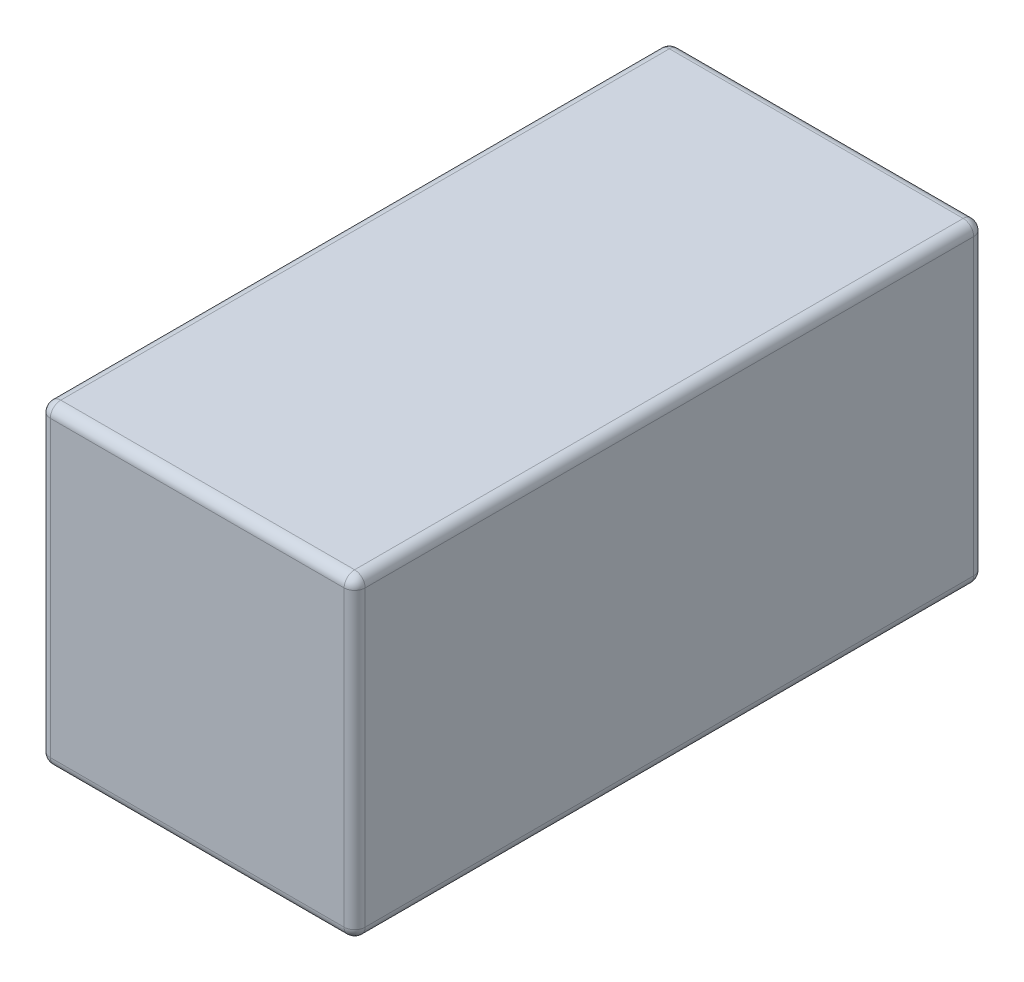
ISO-10303-21;
HEADER;
FILE_DESCRIPTION(('STEP AP214'),'2;1');
FILE_NAME('part.step','',(''),(''),'','','');
FILE_SCHEMA(('AUTOMOTIVE_DESIGN { 1 0 10303 214 1 1 1 1 }'));
ENDSEC;
DATA;
#1=APPLICATION_CONTEXT('core data for automotive mechanical design processes');
#2=APPLICATION_PROTOCOL_DEFINITION('international standard','automotive_design',2000,#1);
#3=PRODUCT_CONTEXT('',#1,'mechanical');
#4=PRODUCT('Part','Part','',(#3));
#5=PRODUCT_RELATED_PRODUCT_CATEGORY('part','',(#4));
#6=PRODUCT_DEFINITION_FORMATION('','',#4);
#7=PRODUCT_DEFINITION_CONTEXT('part definition',#1,'design');
#8=PRODUCT_DEFINITION('design','',#6,#7);
#9=PRODUCT_DEFINITION_SHAPE('','',#8);
#10=(LENGTH_UNIT() NAMED_UNIT(*) SI_UNIT(.MILLI.,.METRE.));
#11=(NAMED_UNIT(*) PLANE_ANGLE_UNIT() SI_UNIT($,.RADIAN.));
#12=(NAMED_UNIT(*) SI_UNIT($,.STERADIAN.) SOLID_ANGLE_UNIT());
#13=UNCERTAINTY_MEASURE_WITH_UNIT(LENGTH_MEASURE(1.E-05),#10,'distance_accuracy_value','');
#14=(GEOMETRIC_REPRESENTATION_CONTEXT(3) GLOBAL_UNCERTAINTY_ASSIGNED_CONTEXT((#13)) GLOBAL_UNIT_ASSIGNED_CONTEXT((#10,
#11,#12)) REPRESENTATION_CONTEXT('',''));
#15=CARTESIAN_POINT('',(0.,0.,0.));
#16=DIRECTION('',(0.,0.,1.));
#17=DIRECTION('',(1.,0.,0.));
#18=AXIS2_PLACEMENT_3D('',#15,#16,#17);
#19=CARTESIAN_POINT('',(3.,-3.00000000000001,6.00000000000001));
#20=DIRECTION('',(0.,1.,0.));
#21=DIRECTION('',(-1.,0.,0.));
#22=AXIS2_PLACEMENT_3D('',#19,#20,#21);
#23=PLANE('',#22);
#24=DIRECTION('',(1.,0.,0.));
#25=VECTOR('',#24,1.);
#26=CARTESIAN_POINT('',(3.,-3.00000000000001,5.8));
#27=LINE('',#26,#25);
#28=CARTESIAN_POINT('',(2.8,-3.,5.8));
#29=VERTEX_POINT('',#28);
#30=CARTESIAN_POINT('',(-2.8,-3.00000000000001,5.8));
#31=VERTEX_POINT('',#30);
#32=EDGE_CURVE('E135',#29,#31,#27,.F.);
#33=ORIENTED_EDGE('',*,*,#32,.T.);
#34=DIRECTION('',(0.,0.,-1.));
#35=VECTOR('',#34,1.);
#36=CARTESIAN_POINT('',(-2.8,-3.00000000000001,6.00000000000001));
#37=LINE('',#36,#35);
#38=CARTESIAN_POINT('',(-2.8,-3.00000000000001,-5.8));
#39=VERTEX_POINT('',#38);
#40=EDGE_CURVE('E178',#31,#39,#37,.T.);
#41=ORIENTED_EDGE('',*,*,#40,.T.);
#42=DIRECTION('',(1.,0.,0.));
#43=VECTOR('',#42,1.);
#44=CARTESIAN_POINT('',(3.,-3.00000000000001,-5.8));
#45=LINE('',#44,#43);
#46=CARTESIAN_POINT('',(2.8,-3.,-5.8));
#47=VERTEX_POINT('',#46);
#48=EDGE_CURVE('E138',#39,#47,#45,.T.);
#49=ORIENTED_EDGE('',*,*,#48,.T.);
#50=DIRECTION('',(0.,0.,-1.));
#51=VECTOR('',#50,1.);
#52=CARTESIAN_POINT('',(2.8,-3.,6.00000000000001));
#53=LINE('',#52,#51);
#54=EDGE_CURVE('E131',#47,#29,#53,.F.);
#55=ORIENTED_EDGE('',*,*,#54,.T.);
#56=EDGE_LOOP('',(#33,#41,#49,#55));
#57=FACE_BOUND('',#56,.T.);
#58=ADVANCED_FACE('F42',(#57),#23,.F.);
#59=CARTESIAN_POINT('',(3.,-3.00000000000001,6.00000000000001));
#60=DIRECTION('',(-1.,0.,0.));
#61=DIRECTION('',(0.,0.,1.));
#62=AXIS2_PLACEMENT_3D('',#59,#60,#61);
#63=PLANE('',#62);
#64=DIRECTION('',(0.,1.,0.));
#65=VECTOR('',#64,1.);
#66=CARTESIAN_POINT('',(3.,2.99999999999999,-5.8));
#67=LINE('',#66,#65);
#68=CARTESIAN_POINT('',(3.,-2.80000000000001,-5.8));
#69=VERTEX_POINT('',#68);
#70=CARTESIAN_POINT('',(3.,2.79999999999999,-5.8));
#71=VERTEX_POINT('',#70);
#72=EDGE_CURVE('E225',#69,#71,#67,.T.);
#73=ORIENTED_EDGE('',*,*,#72,.T.);
#74=DIRECTION('',(0.,0.,-1.));
#75=VECTOR('',#74,1.);
#76=CARTESIAN_POINT('',(3.,2.79999999999999,6.00000000000001));
#77=LINE('',#76,#75);
#78=CARTESIAN_POINT('',(3.,2.79999999999999,5.8));
#79=VERTEX_POINT('',#78);
#80=EDGE_CURVE('E228',#71,#79,#77,.F.);
#81=ORIENTED_EDGE('',*,*,#80,.T.);
#82=DIRECTION('',(0.,1.,0.));
#83=VECTOR('',#82,1.);
#84=CARTESIAN_POINT('',(3.,-3.00000000000001,5.8));
#85=LINE('',#84,#83);
#86=CARTESIAN_POINT('',(3.,-2.80000000000001,5.8));
#87=VERTEX_POINT('',#86);
#88=EDGE_CURVE('E220',#79,#87,#85,.F.);
#89=ORIENTED_EDGE('',*,*,#88,.T.);
#90=DIRECTION('',(0.,0.,-1.));
#91=VECTOR('',#90,1.);
#92=CARTESIAN_POINT('',(3.,-2.80000000000001,6.00000000000001));
#93=LINE('',#92,#91);
#94=EDGE_CURVE('E149',#87,#69,#93,.T.);
#95=ORIENTED_EDGE('',*,*,#94,.T.);
#96=EDGE_LOOP('',(#73,#81,#89,#95));
#97=FACE_BOUND('',#96,.T.);
#98=ADVANCED_FACE('F353',(#97),#63,.F.);
#99=CARTESIAN_POINT('',(3.,2.99999999999999,6.00000000000001));
#100=DIRECTION('',(0.,-1.,0.));
#101=DIRECTION('',(1.,0.,0.));
#102=AXIS2_PLACEMENT_3D('',#99,#100,#101);
#103=PLANE('',#102);
#104=DIRECTION('',(-1.,0.,0.));
#105=VECTOR('',#104,1.);
#106=CARTESIAN_POINT('',(-3.,3.,-5.8));
#107=LINE('',#106,#105);
#108=CARTESIAN_POINT('',(2.8,3.,-5.8));
#109=VERTEX_POINT('',#108);
#110=CARTESIAN_POINT('',(-2.8,2.99999999999999,-5.8));
#111=VERTEX_POINT('',#110);
#112=EDGE_CURVE('E213',#109,#111,#107,.T.);
#113=ORIENTED_EDGE('',*,*,#112,.T.);
#114=DIRECTION('',(0.,0.,-1.));
#115=VECTOR('',#114,1.);
#116=CARTESIAN_POINT('',(-2.8,2.99999999999999,6.00000000000001));
#117=LINE('',#116,#115);
#118=CARTESIAN_POINT('',(-2.8,2.99999999999999,5.8));
#119=VERTEX_POINT('',#118);
#120=EDGE_CURVE('E216',#111,#119,#117,.F.);
#121=ORIENTED_EDGE('',*,*,#120,.T.);
#122=DIRECTION('',(-1.,0.,0.));
#123=VECTOR('',#122,1.);
#124=CARTESIAN_POINT('',(3.,2.99999999999999,5.8));
#125=LINE('',#124,#123);
#126=CARTESIAN_POINT('',(2.8,3.,5.8));
#127=VERTEX_POINT('',#126);
#128=EDGE_CURVE('E207',#119,#127,#125,.F.);
#129=ORIENTED_EDGE('',*,*,#128,.T.);
#130=DIRECTION('',(0.,0.,-1.));
#131=VECTOR('',#130,1.);
#132=CARTESIAN_POINT('',(2.8,3.,6.00000000000001));
#133=LINE('',#132,#131);
#134=EDGE_CURVE('E210',#127,#109,#133,.T.);
#135=ORIENTED_EDGE('',*,*,#134,.T.);
#136=EDGE_LOOP('',(#113,#121,#129,#135));
#137=FACE_BOUND('',#136,.T.);
#138=ADVANCED_FACE('F333',(#137),#103,.F.);
#139=CARTESIAN_POINT('',(-3.,-3.,6.00000000000001));
#140=DIRECTION('',(1.,0.,0.));
#141=DIRECTION('',(0.,0.,-1.));
#142=AXIS2_PLACEMENT_3D('',#139,#140,#141);
#143=PLANE('',#142);
#144=DIRECTION('',(0.,-1.,0.));
#145=VECTOR('',#144,1.);
#146=CARTESIAN_POINT('',(-3.,-3.,-5.8));
#147=LINE('',#146,#145);
#148=CARTESIAN_POINT('',(-3.,2.8,-5.8));
#149=VERTEX_POINT('',#148);
#150=CARTESIAN_POINT('',(-3.,-2.8,-5.8));
#151=VERTEX_POINT('',#150);
#152=EDGE_CURVE('E187',#149,#151,#147,.T.);
#153=ORIENTED_EDGE('',*,*,#152,.T.);
#154=DIRECTION('',(0.,0.,-1.));
#155=VECTOR('',#154,1.);
#156=CARTESIAN_POINT('',(-3.,-2.8,6.00000000000001));
#157=LINE('',#156,#155);
#158=CARTESIAN_POINT('',(-3.,-2.8,5.8));
#159=VERTEX_POINT('',#158);
#160=EDGE_CURVE('E190',#151,#159,#157,.F.);
#161=ORIENTED_EDGE('',*,*,#160,.T.);
#162=DIRECTION('',(0.,-1.,0.));
#163=VECTOR('',#162,1.);
#164=CARTESIAN_POINT('',(-3.,-3.,5.8));
#165=LINE('',#164,#163);
#166=CARTESIAN_POINT('',(-3.,2.8,5.8));
#167=VERTEX_POINT('',#166);
#168=EDGE_CURVE('E181',#159,#167,#165,.F.);
#169=ORIENTED_EDGE('',*,*,#168,.T.);
#170=DIRECTION('',(0.,0.,-1.));
#171=VECTOR('',#170,1.);
#172=CARTESIAN_POINT('',(-3.,2.8,6.00000000000001));
#173=LINE('',#172,#171);
#174=EDGE_CURVE('E184',#167,#149,#173,.T.);
#175=ORIENTED_EDGE('',*,*,#174,.T.);
#176=EDGE_LOOP('',(#153,#161,#169,#175));
#177=FACE_BOUND('',#176,.T.);
#178=ADVANCED_FACE('F360',(#177),#143,.F.);
#179=CARTESIAN_POINT('',(0.,0.,6.00000000000001));
#180=DIRECTION('',(0.,0.,-1.));
#181=DIRECTION('',(-1.,0.,0.));
#182=AXIS2_PLACEMENT_3D('',#179,#180,#181);
#183=PLANE('',#182);
#184=DIRECTION('',(-1.,0.,0.));
#185=VECTOR('',#184,1.);
#186=CARTESIAN_POINT('',(0.,2.8,6.00000000000001));
#187=LINE('',#186,#185);
#188=CARTESIAN_POINT('',(2.8,2.8,6.00000000000001));
#189=VERTEX_POINT('',#188);
#190=CARTESIAN_POINT('',(-2.8,2.79999999999999,6.00000000000001));
#191=VERTEX_POINT('',#190);
#192=EDGE_CURVE('E52',#189,#191,#187,.T.);
#193=ORIENTED_EDGE('',*,*,#192,.T.);
#194=DIRECTION('',(0.,-1.,0.));
#195=VECTOR('',#194,1.);
#196=CARTESIAN_POINT('',(-2.8,0.,6.00000000000001));
#197=LINE('',#196,#195);
#198=CARTESIAN_POINT('',(-2.8,-2.80000000000001,6.00000000000001));
#199=VERTEX_POINT('',#198);
#200=EDGE_CURVE('E11',#191,#199,#197,.T.);
#201=ORIENTED_EDGE('',*,*,#200,.T.);
#202=DIRECTION('',(1.,0.,0.));
#203=VECTOR('',#202,1.);
#204=CARTESIAN_POINT('',(0.,-2.8,6.00000000000001));
#205=LINE('',#204,#203);
#206=CARTESIAN_POINT('',(2.8,-2.8,6.00000000000001));
#207=VERTEX_POINT('',#206);
#208=EDGE_CURVE('E232',#199,#207,#205,.T.);
#209=ORIENTED_EDGE('',*,*,#208,.T.);
#210=DIRECTION('',(0.,1.,0.));
#211=VECTOR('',#210,1.);
#212=CARTESIAN_POINT('',(2.8,0.,6.00000000000001));
#213=LINE('',#212,#211);
#214=EDGE_CURVE('E63',#207,#189,#213,.T.);
#215=ORIENTED_EDGE('',*,*,#214,.T.);
#216=EDGE_LOOP('',(#193,#201,#209,#215));
#217=FACE_BOUND('',#216,.T.);
#218=ADVANCED_FACE('F424',(#217),#183,.F.);
#219=CARTESIAN_POINT('',(0.,0.,-6.00000000000001));
#220=DIRECTION('',(0.,0.,-1.));
#221=DIRECTION('',(-1.,0.,0.));
#222=AXIS2_PLACEMENT_3D('',#219,#220,#221);
#223=PLANE('',#222);
#224=DIRECTION('',(1.,0.,0.));
#225=VECTOR('',#224,1.);
#226=CARTESIAN_POINT('',(-3.,-2.8,-6.00000000000001));
#227=LINE('',#226,#225);
#228=CARTESIAN_POINT('',(2.8,-2.8,-6.00000000000001));
#229=VERTEX_POINT('',#228);
#230=CARTESIAN_POINT('',(-2.8,-2.80000000000001,-6.00000000000001));
#231=VERTEX_POINT('',#230);
#232=EDGE_CURVE('E200',#229,#231,#227,.F.);
#233=ORIENTED_EDGE('',*,*,#232,.T.);
#234=DIRECTION('',(0.,-1.,0.));
#235=VECTOR('',#234,1.);
#236=CARTESIAN_POINT('',(-2.8,2.99999999999999,-6.00000000000001));
#237=LINE('',#236,#235);
#238=CARTESIAN_POINT('',(-2.8,2.79999999999999,-6.00000000000001));
#239=VERTEX_POINT('',#238);
#240=EDGE_CURVE('E203',#231,#239,#237,.F.);
#241=ORIENTED_EDGE('',*,*,#240,.T.);
#242=DIRECTION('',(-1.,0.,0.));
#243=VECTOR('',#242,1.);
#244=CARTESIAN_POINT('',(3.,2.79999999999999,-6.00000000000001));
#245=LINE('',#244,#243);
#246=CARTESIAN_POINT('',(2.8,2.8,-6.00000000000001));
#247=VERTEX_POINT('',#246);
#248=EDGE_CURVE('E197',#239,#247,#245,.F.);
#249=ORIENTED_EDGE('',*,*,#248,.T.);
#250=DIRECTION('',(0.,1.,0.));
#251=VECTOR('',#250,1.);
#252=CARTESIAN_POINT('',(2.8,-3.,-6.00000000000001));
#253=LINE('',#252,#251);
#254=EDGE_CURVE('E194',#247,#229,#253,.F.);
#255=ORIENTED_EDGE('',*,*,#254,.T.);
#256=EDGE_LOOP('',(#233,#241,#249,#255));
#257=FACE_BOUND('',#256,.T.);
#258=ADVANCED_FACE('F324',(#257),#223,.T.);
#259=CARTESIAN_POINT('',(2.8,2.8,6.00000000000001));
#260=DIRECTION('',(0.,0.,-1.));
#261=DIRECTION('',(-1.,0.,0.));
#262=AXIS2_PLACEMENT_3D('',#259,#260,#261);
#263=CYLINDRICAL_SURFACE('',#262,0.2);
#264=CARTESIAN_POINT('',(2.8,2.8,5.8));
#265=DIRECTION('',(0.,0.,1.));
#266=DIRECTION('',(1.,0.,0.));
#267=AXIS2_PLACEMENT_3D('',#264,#265,#266);
#268=CIRCLE('',#267,0.2);
#269=EDGE_CURVE('E46',#79,#127,#268,.T.);
#270=ORIENTED_EDGE('',*,*,#269,.F.);
#271=ORIENTED_EDGE('',*,*,#80,.F.);
#272=CARTESIAN_POINT('',(2.8,2.8,-5.8));
#273=DIRECTION('',(0.,0.,-1.));
#274=DIRECTION('',(-1.,0.,0.));
#275=AXIS2_PLACEMENT_3D('',#272,#273,#274);
#276=CIRCLE('',#275,0.2);
#277=EDGE_CURVE('E174',#109,#71,#276,.T.);
#278=ORIENTED_EDGE('',*,*,#277,.F.);
#279=ORIENTED_EDGE('',*,*,#134,.F.);
#280=EDGE_LOOP('',(#270,#271,#278,#279));
#281=FACE_BOUND('',#280,.T.);
#282=ADVANCED_FACE('F44',(#281),#263,.T.);
#283=CARTESIAN_POINT('',(2.8,2.8,5.8));
#284=DIRECTION('',(0.,0.,1.));
#285=DIRECTION('',(1.,0.,0.));
#286=AXIS2_PLACEMENT_3D('',#283,#284,#285);
#287=SPHERICAL_SURFACE('',#286,0.2);
#288=CARTESIAN_POINT('',(2.8,2.8,5.8));
#289=DIRECTION('',(0.,1.,0.));
#290=DIRECTION('',(0.,0.,1.));
#291=AXIS2_PLACEMENT_3D('',#288,#289,#290);
#292=CIRCLE('',#291,0.2);
#293=EDGE_CURVE('E299',#79,#189,#292,.F.);
#294=ORIENTED_EDGE('',*,*,#293,.F.);
#295=ORIENTED_EDGE('',*,*,#269,.T.);
#296=CARTESIAN_POINT('',(2.8,2.8,5.8));
#297=DIRECTION('',(1.,0.,0.));
#298=DIRECTION('',(0.,0.,-1.));
#299=AXIS2_PLACEMENT_3D('',#296,#297,#298);
#300=CIRCLE('',#299,0.2);
#301=EDGE_CURVE('E302',#189,#127,#300,.F.);
#302=ORIENTED_EDGE('',*,*,#301,.F.);
#303=EDGE_LOOP('',(#294,#295,#302));
#304=FACE_BOUND('',#303,.T.);
#305=ADVANCED_FACE('F349',(#304),#287,.T.);
#306=CARTESIAN_POINT('',(2.8,2.8,-5.8));
#307=DIRECTION('',(0.,0.,1.));
#308=DIRECTION('',(1.,0.,0.));
#309=AXIS2_PLACEMENT_3D('',#306,#307,#308);
#310=SPHERICAL_SURFACE('',#309,0.2);
#311=CARTESIAN_POINT('',(2.8,2.8,-5.8));
#312=DIRECTION('',(1.,0.,0.));
#313=DIRECTION('',(0.,0.,-1.));
#314=AXIS2_PLACEMENT_3D('',#311,#312,#313);
#315=CIRCLE('',#314,0.2);
#316=EDGE_CURVE('E291',#109,#247,#315,.F.);
#317=ORIENTED_EDGE('',*,*,#316,.F.);
#318=ORIENTED_EDGE('',*,*,#277,.T.);
#319=CARTESIAN_POINT('',(2.8,2.8,-5.8));
#320=DIRECTION('',(0.,1.,0.));
#321=DIRECTION('',(0.,0.,1.));
#322=AXIS2_PLACEMENT_3D('',#319,#320,#321);
#323=CIRCLE('',#322,0.2);
#324=EDGE_CURVE('E295',#247,#71,#323,.F.);
#325=ORIENTED_EDGE('',*,*,#324,.F.);
#326=EDGE_LOOP('',(#317,#318,#325));
#327=FACE_BOUND('',#326,.T.);
#328=ADVANCED_FACE('F312',(#327),#310,.T.);
#329=CARTESIAN_POINT('',(0.,2.8,5.8));
#330=DIRECTION('',(-1.,0.,0.));
#331=DIRECTION('',(0.,-1.,0.));
#332=AXIS2_PLACEMENT_3D('',#329,#330,#331);
#333=CYLINDRICAL_SURFACE('',#332,0.2);
#334=ORIENTED_EDGE('',*,*,#301,.T.);
#335=ORIENTED_EDGE('',*,*,#128,.F.);
#336=CARTESIAN_POINT('',(-2.8,2.79999999999999,5.8));
#337=DIRECTION('',(-1.,0.,0.));
#338=DIRECTION('',(0.,0.,1.));
#339=AXIS2_PLACEMENT_3D('',#336,#337,#338);
#340=CIRCLE('',#339,0.2);
#341=EDGE_CURVE('E284',#191,#119,#340,.T.);
#342=ORIENTED_EDGE('',*,*,#341,.F.);
#343=ORIENTED_EDGE('',*,*,#192,.F.);
#344=EDGE_LOOP('',(#334,#335,#342,#343));
#345=FACE_BOUND('',#344,.T.);
#346=ADVANCED_FACE('F344',(#345),#333,.T.);
#347=CARTESIAN_POINT('',(2.8,0.,5.8));
#348=DIRECTION('',(0.,1.,0.));
#349=DIRECTION('',(0.,0.,1.));
#350=AXIS2_PLACEMENT_3D('',#347,#348,#349);
#351=CYLINDRICAL_SURFACE('',#350,0.2);
#352=ORIENTED_EDGE('',*,*,#293,.T.);
#353=ORIENTED_EDGE('',*,*,#214,.F.);
#354=CARTESIAN_POINT('',(2.8,-2.8,5.8));
#355=DIRECTION('',(0.,-1.,0.));
#356=DIRECTION('',(0.,0.,-1.));
#357=AXIS2_PLACEMENT_3D('',#354,#355,#356);
#358=CIRCLE('',#357,0.2);
#359=EDGE_CURVE('E154',#87,#207,#358,.T.);
#360=ORIENTED_EDGE('',*,*,#359,.F.);
#361=ORIENTED_EDGE('',*,*,#88,.F.);
#362=EDGE_LOOP('',(#352,#353,#360,#361));
#363=FACE_BOUND('',#362,.T.);
#364=ADVANCED_FACE('F351',(#363),#351,.T.);
#365=CARTESIAN_POINT('',(2.8,-2.8,6.00000000000001));
#366=DIRECTION('',(0.,0.,-1.));
#367=DIRECTION('',(-1.,0.,0.));
#368=AXIS2_PLACEMENT_3D('',#365,#366,#367);
#369=CYLINDRICAL_SURFACE('',#368,0.2);
#370=CARTESIAN_POINT('',(2.8,-2.8,-5.8));
#371=DIRECTION('',(0.,0.,-1.));
#372=DIRECTION('',(-1.,0.,0.));
#373=AXIS2_PLACEMENT_3D('',#370,#371,#372);
#374=CIRCLE('',#373,0.2);
#375=EDGE_CURVE('E155',#69,#47,#374,.T.);
#376=ORIENTED_EDGE('',*,*,#375,.F.);
#377=ORIENTED_EDGE('',*,*,#94,.F.);
#378=CARTESIAN_POINT('',(2.8,-2.8,5.8));
#379=DIRECTION('',(0.,0.,1.));
#380=DIRECTION('',(1.,0.,0.));
#381=AXIS2_PLACEMENT_3D('',#378,#379,#380);
#382=CIRCLE('',#381,0.2);
#383=EDGE_CURVE('E146',#29,#87,#382,.T.);
#384=ORIENTED_EDGE('',*,*,#383,.F.);
#385=ORIENTED_EDGE('',*,*,#54,.F.);
#386=EDGE_LOOP('',(#376,#377,#384,#385));
#387=FACE_BOUND('',#386,.T.);
#388=ADVANCED_FACE('F148',(#387),#369,.T.);
#389=CARTESIAN_POINT('',(2.8,-3.,-5.8));
#390=DIRECTION('',(0.,-1.,0.));
#391=DIRECTION('',(0.,0.,-1.));
#392=AXIS2_PLACEMENT_3D('',#389,#390,#391);
#393=CYLINDRICAL_SURFACE('',#392,0.2);
#394=ORIENTED_EDGE('',*,*,#324,.T.);
#395=ORIENTED_EDGE('',*,*,#72,.F.);
#396=CARTESIAN_POINT('',(2.8,-2.8,-5.8));
#397=DIRECTION('',(0.,-1.,0.));
#398=DIRECTION('',(0.,0.,-1.));
#399=AXIS2_PLACEMENT_3D('',#396,#397,#398);
#400=CIRCLE('',#399,0.2);
#401=EDGE_CURVE('E276',#229,#69,#400,.T.);
#402=ORIENTED_EDGE('',*,*,#401,.F.);
#403=ORIENTED_EDGE('',*,*,#254,.F.);
#404=EDGE_LOOP('',(#394,#395,#402,#403));
#405=FACE_BOUND('',#404,.T.);
#406=ADVANCED_FACE('F320',(#405),#393,.T.);
#407=CARTESIAN_POINT('',(3.,2.79999999999999,-5.8));
#408=DIRECTION('',(1.,0.,0.));
#409=DIRECTION('',(0.,1.,0.));
#410=AXIS2_PLACEMENT_3D('',#407,#408,#409);
#411=CYLINDRICAL_SURFACE('',#410,0.2);
#412=ORIENTED_EDGE('',*,*,#316,.T.);
#413=ORIENTED_EDGE('',*,*,#248,.F.);
#414=CARTESIAN_POINT('',(-2.8,2.79999999999999,-5.8));
#415=DIRECTION('',(-1.,0.,0.));
#416=DIRECTION('',(0.,0.,1.));
#417=AXIS2_PLACEMENT_3D('',#414,#415,#416);
#418=CIRCLE('',#417,0.2);
#419=EDGE_CURVE('E272',#111,#239,#418,.T.);
#420=ORIENTED_EDGE('',*,*,#419,.F.);
#421=ORIENTED_EDGE('',*,*,#112,.F.);
#422=EDGE_LOOP('',(#412,#413,#420,#421));
#423=FACE_BOUND('',#422,.T.);
#424=ADVANCED_FACE('F330',(#423),#411,.T.);
#425=CARTESIAN_POINT('',(-2.8,2.79999999999999,6.00000000000001));
#426=DIRECTION('',(0.,0.,-1.));
#427=DIRECTION('',(-1.,0.,0.));
#428=AXIS2_PLACEMENT_3D('',#425,#426,#427);
#429=CYLINDRICAL_SURFACE('',#428,0.2);
#430=CARTESIAN_POINT('',(-2.8,2.79999999999999,5.8));
#431=DIRECTION('',(0.,0.,1.));
#432=DIRECTION('',(1.,0.,0.));
#433=AXIS2_PLACEMENT_3D('',#430,#431,#432);
#434=CIRCLE('',#433,0.2);
#435=EDGE_CURVE('E287',#119,#167,#434,.T.);
#436=ORIENTED_EDGE('',*,*,#435,.F.);
#437=ORIENTED_EDGE('',*,*,#120,.F.);
#438=CARTESIAN_POINT('',(-2.8,2.79999999999999,-5.8));
#439=DIRECTION('',(0.,0.,-1.));
#440=DIRECTION('',(-1.,0.,0.));
#441=AXIS2_PLACEMENT_3D('',#438,#439,#440);
#442=CIRCLE('',#441,0.2);
#443=EDGE_CURVE('E268',#149,#111,#442,.T.);
#444=ORIENTED_EDGE('',*,*,#443,.F.);
#445=ORIENTED_EDGE('',*,*,#174,.F.);
#446=EDGE_LOOP('',(#436,#437,#444,#445));
#447=FACE_BOUND('',#446,.T.);
#448=ADVANCED_FACE('F337',(#447),#429,.T.);
#449=CARTESIAN_POINT('',(-2.8,2.79999999999999,5.8));
#450=DIRECTION('',(0.,0.,1.));
#451=DIRECTION('',(1.,0.,0.));
#452=AXIS2_PLACEMENT_3D('',#449,#450,#451);
#453=SPHERICAL_SURFACE('',#452,0.2);
#454=ORIENTED_EDGE('',*,*,#341,.T.);
#455=ORIENTED_EDGE('',*,*,#435,.T.);
#456=CARTESIAN_POINT('',(-2.8,2.79999999999999,5.8));
#457=DIRECTION('',(0.,1.,0.));
#458=DIRECTION('',(0.,0.,1.));
#459=AXIS2_PLACEMENT_3D('',#456,#457,#458);
#460=CIRCLE('',#459,0.2);
#461=EDGE_CURVE('E163',#191,#167,#460,.F.);
#462=ORIENTED_EDGE('',*,*,#461,.F.);
#463=EDGE_LOOP('',(#454,#455,#462));
#464=FACE_BOUND('',#463,.T.);
#465=ADVANCED_FACE('F401',(#464),#453,.T.);
#466=CARTESIAN_POINT('',(2.8,-2.8,5.8));
#467=DIRECTION('',(0.,0.,1.));
#468=DIRECTION('',(1.,0.,0.));
#469=AXIS2_PLACEMENT_3D('',#466,#467,#468);
#470=SPHERICAL_SURFACE('',#469,0.2);
#471=ORIENTED_EDGE('',*,*,#383,.T.);
#472=ORIENTED_EDGE('',*,*,#359,.T.);
#473=CARTESIAN_POINT('',(2.8,-2.8,5.8));
#474=DIRECTION('',(1.,0.,0.));
#475=DIRECTION('',(0.,0.,-1.));
#476=AXIS2_PLACEMENT_3D('',#473,#474,#475);
#477=CIRCLE('',#476,0.2);
#478=EDGE_CURVE('E158',#29,#207,#477,.F.);
#479=ORIENTED_EDGE('',*,*,#478,.F.);
#480=EDGE_LOOP('',(#471,#472,#479));
#481=FACE_BOUND('',#480,.T.);
#482=ADVANCED_FACE('F159',(#481),#470,.T.);
#483=CARTESIAN_POINT('',(2.8,-2.8,-5.8));
#484=DIRECTION('',(0.,0.,1.));
#485=DIRECTION('',(1.,0.,0.));
#486=AXIS2_PLACEMENT_3D('',#483,#484,#485);
#487=SPHERICAL_SURFACE('',#486,0.2);
#488=ORIENTED_EDGE('',*,*,#401,.T.);
#489=ORIENTED_EDGE('',*,*,#375,.T.);
#490=CARTESIAN_POINT('',(2.8,-2.8,-5.8));
#491=DIRECTION('',(1.,0.,0.));
#492=DIRECTION('',(0.,0.,-1.));
#493=AXIS2_PLACEMENT_3D('',#490,#491,#492);
#494=CIRCLE('',#493,0.2);
#495=EDGE_CURVE('E164',#229,#47,#494,.F.);
#496=ORIENTED_EDGE('',*,*,#495,.F.);
#497=EDGE_LOOP('',(#488,#489,#496));
#498=FACE_BOUND('',#497,.T.);
#499=ADVANCED_FACE('F394',(#498),#487,.T.);
#500=CARTESIAN_POINT('',(-2.8,2.79999999999999,-5.8));
#501=DIRECTION('',(0.,0.,1.));
#502=DIRECTION('',(1.,0.,0.));
#503=AXIS2_PLACEMENT_3D('',#500,#501,#502);
#504=SPHERICAL_SURFACE('',#503,0.2);
#505=ORIENTED_EDGE('',*,*,#443,.T.);
#506=ORIENTED_EDGE('',*,*,#419,.T.);
#507=CARTESIAN_POINT('',(-2.8,2.79999999999999,-5.8));
#508=DIRECTION('',(0.,1.,0.));
#509=DIRECTION('',(-1.,0.,0.));
#510=AXIS2_PLACEMENT_3D('',#507,#508,#509);
#511=CIRCLE('',#510,0.2);
#512=EDGE_CURVE('E259',#149,#239,#511,.F.);
#513=ORIENTED_EDGE('',*,*,#512,.F.);
#514=EDGE_LOOP('',(#505,#506,#513));
#515=FACE_BOUND('',#514,.T.);
#516=ADVANCED_FACE('F390',(#515),#504,.T.);
#517=CARTESIAN_POINT('',(-2.8,0.,5.8));
#518=DIRECTION('',(0.,-1.,0.));
#519=DIRECTION('',(0.,0.,-1.));
#520=AXIS2_PLACEMENT_3D('',#517,#518,#519);
#521=CYLINDRICAL_SURFACE('',#520,0.2);
#522=ORIENTED_EDGE('',*,*,#461,.T.);
#523=ORIENTED_EDGE('',*,*,#168,.F.);
#524=CARTESIAN_POINT('',(-2.8,-2.80000000000001,5.8));
#525=DIRECTION('',(0.,-1.,0.));
#526=DIRECTION('',(0.,0.,-1.));
#527=AXIS2_PLACEMENT_3D('',#524,#525,#526);
#528=CIRCLE('',#527,0.2);
#529=EDGE_CURVE('E255',#199,#159,#528,.T.);
#530=ORIENTED_EDGE('',*,*,#529,.F.);
#531=ORIENTED_EDGE('',*,*,#200,.F.);
#532=EDGE_LOOP('',(#522,#523,#530,#531));
#533=FACE_BOUND('',#532,.T.);
#534=ADVANCED_FACE('F387',(#533),#521,.T.);
#535=CARTESIAN_POINT('',(0.,-2.8,5.8));
#536=DIRECTION('',(1.,0.,0.));
#537=DIRECTION('',(0.,1.,0.));
#538=AXIS2_PLACEMENT_3D('',#535,#536,#537);
#539=CYLINDRICAL_SURFACE('',#538,0.2);
#540=ORIENTED_EDGE('',*,*,#478,.T.);
#541=ORIENTED_EDGE('',*,*,#208,.F.);
#542=CARTESIAN_POINT('',(-2.8,-2.80000000000001,5.8));
#543=DIRECTION('',(-1.,0.,0.));
#544=DIRECTION('',(0.,0.,1.));
#545=AXIS2_PLACEMENT_3D('',#542,#543,#544);
#546=CIRCLE('',#545,0.2);
#547=EDGE_CURVE('E167',#31,#199,#546,.T.);
#548=ORIENTED_EDGE('',*,*,#547,.F.);
#549=ORIENTED_EDGE('',*,*,#32,.F.);
#550=EDGE_LOOP('',(#540,#541,#548,#549));
#551=FACE_BOUND('',#550,.T.);
#552=ADVANCED_FACE('F166',(#551),#539,.T.);
#553=CARTESIAN_POINT('',(3.,-2.80000000000001,-5.8));
#554=DIRECTION('',(-1.,0.,0.));
#555=DIRECTION('',(0.,-1.,0.));
#556=AXIS2_PLACEMENT_3D('',#553,#554,#555);
#557=CYLINDRICAL_SURFACE('',#556,0.2);
#558=ORIENTED_EDGE('',*,*,#495,.T.);
#559=ORIENTED_EDGE('',*,*,#48,.F.);
#560=CARTESIAN_POINT('',(-2.8,-2.80000000000001,-5.8));
#561=DIRECTION('',(-1.,0.,0.));
#562=DIRECTION('',(0.,0.,1.));
#563=AXIS2_PLACEMENT_3D('',#560,#561,#562);
#564=CIRCLE('',#563,0.2);
#565=EDGE_CURVE('E249',#231,#39,#564,.T.);
#566=ORIENTED_EDGE('',*,*,#565,.F.);
#567=ORIENTED_EDGE('',*,*,#232,.F.);
#568=EDGE_LOOP('',(#558,#559,#566,#567));
#569=FACE_BOUND('',#568,.T.);
#570=ADVANCED_FACE('F380',(#569),#557,.T.);
#571=CARTESIAN_POINT('',(-2.8,-3.00000000000001,-5.8));
#572=DIRECTION('',(0.,1.,0.));
#573=DIRECTION('',(0.,0.,1.));
#574=AXIS2_PLACEMENT_3D('',#571,#572,#573);
#575=CYLINDRICAL_SURFACE('',#574,0.2);
#576=ORIENTED_EDGE('',*,*,#512,.T.);
#577=ORIENTED_EDGE('',*,*,#240,.F.);
#578=CARTESIAN_POINT('',(-2.8,-2.80000000000001,-5.8));
#579=DIRECTION('',(0.,-1.,0.));
#580=DIRECTION('',(0.,0.,-1.));
#581=AXIS2_PLACEMENT_3D('',#578,#579,#580);
#582=CIRCLE('',#581,0.2);
#583=EDGE_CURVE('E245',#151,#231,#582,.T.);
#584=ORIENTED_EDGE('',*,*,#583,.F.);
#585=ORIENTED_EDGE('',*,*,#152,.F.);
#586=EDGE_LOOP('',(#576,#577,#584,#585));
#587=FACE_BOUND('',#586,.T.);
#588=ADVANCED_FACE('F376',(#587),#575,.T.);
#589=CARTESIAN_POINT('',(-2.8,-2.80000000000001,5.8));
#590=DIRECTION('',(0.,0.,1.));
#591=DIRECTION('',(1.,0.,0.));
#592=AXIS2_PLACEMENT_3D('',#589,#590,#591);
#593=SPHERICAL_SURFACE('',#592,0.2);
#594=ORIENTED_EDGE('',*,*,#547,.T.);
#595=ORIENTED_EDGE('',*,*,#529,.T.);
#596=CARTESIAN_POINT('',(-2.8,-2.80000000000001,5.8));
#597=DIRECTION('',(0.,0.,1.));
#598=DIRECTION('',(1.,0.,0.));
#599=AXIS2_PLACEMENT_3D('',#596,#597,#598);
#600=CIRCLE('',#599,0.2);
#601=EDGE_CURVE('E242',#31,#159,#600,.F.);
#602=ORIENTED_EDGE('',*,*,#601,.F.);
#603=EDGE_LOOP('',(#594,#595,#602));
#604=FACE_BOUND('',#603,.T.);
#605=ADVANCED_FACE('F372',(#604),#593,.T.);
#606=CARTESIAN_POINT('',(-2.8,-2.80000000000001,-5.8));
#607=DIRECTION('',(0.,0.,1.));
#608=DIRECTION('',(1.,0.,0.));
#609=AXIS2_PLACEMENT_3D('',#606,#607,#608);
#610=SPHERICAL_SURFACE('',#609,0.2);
#611=ORIENTED_EDGE('',*,*,#583,.T.);
#612=ORIENTED_EDGE('',*,*,#565,.T.);
#613=CARTESIAN_POINT('',(-2.8,-2.80000000000001,-5.8));
#614=DIRECTION('',(0.,0.,-1.));
#615=DIRECTION('',(-1.,0.,0.));
#616=AXIS2_PLACEMENT_3D('',#613,#614,#615);
#617=CIRCLE('',#616,0.2);
#618=EDGE_CURVE('E239',#151,#39,#617,.F.);
#619=ORIENTED_EDGE('',*,*,#618,.F.);
#620=EDGE_LOOP('',(#611,#612,#619));
#621=FACE_BOUND('',#620,.T.);
#622=ADVANCED_FACE('F368',(#621),#610,.T.);
#623=CARTESIAN_POINT('',(-2.8,-2.80000000000001,6.00000000000001));
#624=DIRECTION('',(0.,0.,-1.));
#625=DIRECTION('',(-1.,0.,0.));
#626=AXIS2_PLACEMENT_3D('',#623,#624,#625);
#627=CYLINDRICAL_SURFACE('',#626,0.2);
#628=ORIENTED_EDGE('',*,*,#601,.T.);
#629=ORIENTED_EDGE('',*,*,#160,.F.);
#630=ORIENTED_EDGE('',*,*,#618,.T.);
#631=ORIENTED_EDGE('',*,*,#40,.F.);
#632=EDGE_LOOP('',(#628,#629,#630,#631));
#633=FACE_BOUND('',#632,.T.);
#634=ADVANCED_FACE('F365',(#633),#627,.T.);
#635=CLOSED_SHELL('',(#58,#98,#138,#178,#218,#258,#282,#305,#328,#346,#364,#388,#406,#424,#448,
#465,#482,#499,#516,#534,#552,#570,#588,#605,#622,#634));
#636=MANIFOLD_SOLID_BREP('B2',#635);
#637=ADVANCED_BREP_SHAPE_REPRESENTATION('',(#18,#636),#14);
#638=SHAPE_DEFINITION_REPRESENTATION(#9,#637);
ENDSEC;
END-ISO-10303-21;
